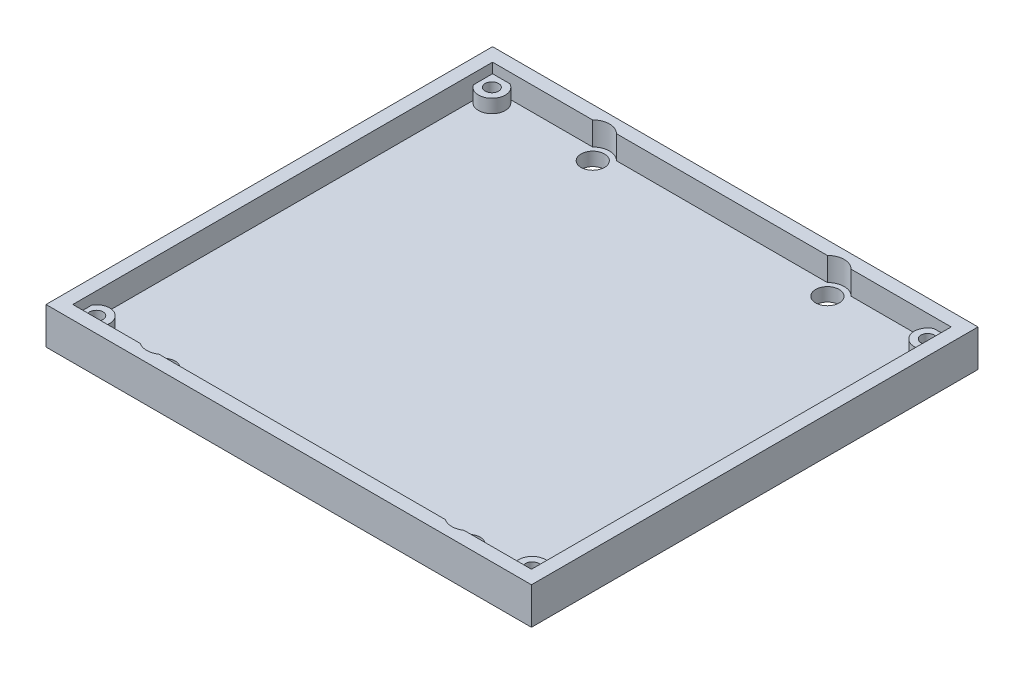
ISO-10303-21;
HEADER;
FILE_DESCRIPTION(('STEP AP214'),'2;1');
FILE_NAME('part.step','',(''),(''),'','','');
FILE_SCHEMA(('AUTOMOTIVE_DESIGN { 1 0 10303 214 1 1 1 1 }'));
ENDSEC;
DATA;
#1=APPLICATION_CONTEXT('core data for automotive mechanical design processes');
#2=APPLICATION_PROTOCOL_DEFINITION('international standard','automotive_design',2000,#1);
#3=PRODUCT_CONTEXT('',#1,'mechanical');
#4=PRODUCT('Part','Part','',(#3));
#5=PRODUCT_RELATED_PRODUCT_CATEGORY('part','',(#4));
#6=PRODUCT_DEFINITION_FORMATION('','',#4);
#7=PRODUCT_DEFINITION_CONTEXT('part definition',#1,'design');
#8=PRODUCT_DEFINITION('design','',#6,#7);
#9=PRODUCT_DEFINITION_SHAPE('','',#8);
#10=(LENGTH_UNIT() NAMED_UNIT(*) SI_UNIT(.MILLI.,.METRE.));
#11=(NAMED_UNIT(*) PLANE_ANGLE_UNIT() SI_UNIT($,.RADIAN.));
#12=(NAMED_UNIT(*) SI_UNIT($,.STERADIAN.) SOLID_ANGLE_UNIT());
#13=UNCERTAINTY_MEASURE_WITH_UNIT(LENGTH_MEASURE(1.E-05),#10,'distance_accuracy_value','');
#14=(GEOMETRIC_REPRESENTATION_CONTEXT(3) GLOBAL_UNCERTAINTY_ASSIGNED_CONTEXT((#13)) GLOBAL_UNIT_ASSIGNED_CONTEXT((#10,
#11,#12)) REPRESENTATION_CONTEXT('',''));
#15=CARTESIAN_POINT('',(0.,0.,0.));
#16=DIRECTION('',(0.,0.,1.));
#17=DIRECTION('',(1.,0.,0.));
#18=AXIS2_PLACEMENT_3D('',#15,#16,#17);
#19=CARTESIAN_POINT('',(0.,4.,0.));
#20=DIRECTION('',(0.,1.,0.));
#21=DIRECTION('',(0.,0.,1.));
#22=AXIS2_PLACEMENT_3D('',#19,#20,#21);
#23=PLANE('',#22);
#24=CARTESIAN_POINT('',(3.6999999999998,4.,-62.8));
#25=DIRECTION('',(0.,1.,0.));
#26=DIRECTION('',(0.,0.,1.));
#27=AXIS2_PLACEMENT_3D('',#24,#25,#26);
#28=CIRCLE('',#27,1.);
#29=CARTESIAN_POINT('',(3.6999999999998,4.,-61.8));
#30=VERTEX_POINT('',#29);
#31=EDGE_CURVE('E339',#30,#30,#28,.T.);
#32=ORIENTED_EDGE('',*,*,#31,.F.);
#33=EDGE_LOOP('',(#32));
#34=FACE_BOUND('',#33,.T.);
#35=CARTESIAN_POINT('',(3.6999999999998,4.,-62.8));
#36=DIRECTION('',(0.,1.,0.));
#37=DIRECTION('',(0.,0.,1.));
#38=AXIS2_PLACEMENT_3D('',#35,#36,#37);
#39=CIRCLE('',#38,2.);
#40=CARTESIAN_POINT('',(4.57177978870794,4.,-64.6));
#41=VERTEX_POINT('',#40);
#42=CARTESIAN_POINT('',(2.,4.,-61.7464346247144));
#43=VERTEX_POINT('',#42);
#44=EDGE_CURVE('E320',#41,#43,#39,.F.);
#45=ORIENTED_EDGE('',*,*,#44,.F.);
#46=DIRECTION('',(-1.,0.,0.));
#47=VECTOR('',#46,1.);
#48=CARTESIAN_POINT('',(16.9208761165389,4.,-64.6));
#49=LINE('',#48,#47);
#50=CARTESIAN_POINT('',(2.,4.,-64.6));
#51=VERTEX_POINT('',#50);
#52=EDGE_CURVE('E11',#41,#51,#49,.T.);
#53=ORIENTED_EDGE('',*,*,#52,.T.);
#54=DIRECTION('',(0.,0.,1.));
#55=VECTOR('',#54,1.);
#56=CARTESIAN_POINT('',(2.,4.,-2.));
#57=LINE('',#56,#55);
#58=EDGE_CURVE('E223',#51,#43,#57,.T.);
#59=ORIENTED_EDGE('',*,*,#58,.T.);
#60=EDGE_LOOP('',(#45,#53,#59));
#61=FACE_BOUND('',#60,.T.);
#62=ADVANCED_FACE('F41',(#34,#61),#23,.T.);
#63=CARTESIAN_POINT('',(3.7,4.,-3.8));
#64=DIRECTION('',(0.,1.,0.));
#65=DIRECTION('',(0.,0.,1.));
#66=AXIS2_PLACEMENT_3D('',#63,#64,#65);
#67=CIRCLE('',#66,1.);
#68=CARTESIAN_POINT('',(3.7,4.,-2.8));
#69=VERTEX_POINT('',#68);
#70=EDGE_CURVE('E327',#69,#69,#67,.T.);
#71=ORIENTED_EDGE('',*,*,#70,.F.);
#72=EDGE_LOOP('',(#71));
#73=FACE_BOUND('',#72,.T.);
#74=CARTESIAN_POINT('',(3.7,4.,-3.8));
#75=DIRECTION('',(0.,1.,0.));
#76=DIRECTION('',(0.,0.,1.));
#77=AXIS2_PLACEMENT_3D('',#74,#75,#76);
#78=CIRCLE('',#77,2.00000000000004);
#79=CARTESIAN_POINT('',(4.57177978870824,4.,-2.));
#80=VERTEX_POINT('',#79);
#81=CARTESIAN_POINT('',(2.,4.,-4.85356537528535));
#82=VERTEX_POINT('',#81);
#83=EDGE_CURVE('E316',#80,#82,#78,.T.);
#84=ORIENTED_EDGE('',*,*,#83,.T.);
#85=CARTESIAN_POINT('',(2.,4.,-2.));
#86=VERTEX_POINT('',#85);
#87=EDGE_CURVE('E51',#82,#86,#57,.T.);
#88=ORIENTED_EDGE('',*,*,#87,.T.);
#89=DIRECTION('',(1.,0.,0.));
#90=VECTOR('',#89,1.);
#91=CARTESIAN_POINT('',(12.0596299357219,4.,-2.));
#92=LINE('',#91,#90);
#93=EDGE_CURVE('E274',#86,#80,#92,.T.);
#94=ORIENTED_EDGE('',*,*,#93,.T.);
#95=EDGE_LOOP('',(#84,#88,#94));
#96=FACE_BOUND('',#95,.T.);
#97=ADVANCED_FACE('F608',(#73,#96),#23,.T.);
#98=CARTESIAN_POINT('',(68.7,4.,-3.8));
#99=DIRECTION('',(0.,1.,0.));
#100=DIRECTION('',(0.,0.,1.));
#101=AXIS2_PLACEMENT_3D('',#98,#99,#100);
#102=CIRCLE('',#101,0.999999999999998);
#103=CARTESIAN_POINT('',(68.7,4.,-2.8));
#104=VERTEX_POINT('',#103);
#105=EDGE_CURVE('E331',#104,#104,#102,.T.);
#106=ORIENTED_EDGE('',*,*,#105,.F.);
#107=EDGE_LOOP('',(#106));
#108=FACE_BOUND('',#107,.T.);
#109=CARTESIAN_POINT('',(68.7,4.,-3.8));
#110=DIRECTION('',(0.,1.,0.));
#111=DIRECTION('',(0.,0.,1.));
#112=AXIS2_PLACEMENT_3D('',#109,#110,#111);
#113=CIRCLE('',#112,2.00000000000004);
#114=CARTESIAN_POINT('',(67.828220211292,4.,-2.));
#115=VERTEX_POINT('',#114);
#116=CARTESIAN_POINT('',(70.4,4.,-4.85356537528536));
#117=VERTEX_POINT('',#116);
#118=EDGE_CURVE('E312',#115,#117,#113,.F.);
#119=ORIENTED_EDGE('',*,*,#118,.F.);
#120=DIRECTION('',(1.,0.,0.));
#121=VECTOR('',#120,1.);
#122=CARTESIAN_POINT('',(70.4,4.,-2.));
#123=LINE('',#122,#121);
#124=CARTESIAN_POINT('',(70.4,4.,-2.));
#125=VERTEX_POINT('',#124);
#126=EDGE_CURVE('E278',#115,#125,#123,.T.);
#127=ORIENTED_EDGE('',*,*,#126,.T.);
#128=DIRECTION('',(0.,0.,-1.));
#129=VECTOR('',#128,1.);
#130=CARTESIAN_POINT('',(70.4,4.,-2.));
#131=LINE('',#130,#129);
#132=EDGE_CURVE('E277',#125,#117,#131,.T.);
#133=ORIENTED_EDGE('',*,*,#132,.T.);
#134=EDGE_LOOP('',(#119,#127,#133));
#135=FACE_BOUND('',#134,.T.);
#136=ADVANCED_FACE('F564',(#108,#135),#23,.T.);
#137=CARTESIAN_POINT('',(68.6999999999998,4.,-62.8));
#138=DIRECTION('',(0.,1.,0.));
#139=DIRECTION('',(0.,0.,1.));
#140=AXIS2_PLACEMENT_3D('',#137,#138,#139);
#141=CIRCLE('',#140,0.999999999999998);
#142=CARTESIAN_POINT('',(68.6999999999998,4.,-61.8));
#143=VERTEX_POINT('',#142);
#144=EDGE_CURVE('E335',#143,#143,#141,.T.);
#145=ORIENTED_EDGE('',*,*,#144,.F.);
#146=EDGE_LOOP('',(#145));
#147=FACE_BOUND('',#146,.T.);
#148=CARTESIAN_POINT('',(68.6999999999998,4.,-62.8));
#149=DIRECTION('',(0.,1.,0.));
#150=DIRECTION('',(0.,0.,1.));
#151=AXIS2_PLACEMENT_3D('',#148,#149,#150);
#152=CIRCLE('',#151,2.00000000000008);
#153=CARTESIAN_POINT('',(67.828220211292,4.,-64.6));
#154=VERTEX_POINT('',#153);
#155=CARTESIAN_POINT('',(70.4,4.,-61.7464346247144));
#156=VERTEX_POINT('',#155);
#157=EDGE_CURVE('E324',#154,#156,#152,.T.);
#158=ORIENTED_EDGE('',*,*,#157,.T.);
#159=CARTESIAN_POINT('',(70.4,4.,-64.6));
#160=VERTEX_POINT('',#159);
#161=EDGE_CURVE('E281',#156,#160,#131,.T.);
#162=ORIENTED_EDGE('',*,*,#161,.T.);
#163=DIRECTION('',(-1.,0.,0.));
#164=VECTOR('',#163,1.);
#165=CARTESIAN_POINT('',(70.4,4.,-64.6));
#166=LINE('',#165,#164);
#167=EDGE_CURVE('E216',#160,#154,#166,.T.);
#168=ORIENTED_EDGE('',*,*,#167,.T.);
#169=EDGE_LOOP('',(#158,#162,#168));
#170=FACE_BOUND('',#169,.T.);
#171=ADVANCED_FACE('F538',(#147,#170),#23,.T.);
#172=CARTESIAN_POINT('',(0.,2.,0.));
#173=DIRECTION('',(0.,-1.,0.));
#174=DIRECTION('',(0.,0.,-1.));
#175=AXIS2_PLACEMENT_3D('',#172,#173,#174);
#176=PLANE('',#175);
#177=CARTESIAN_POINT('',(53.7,2.,-62.8436634128681));
#178=DIRECTION('',(0.,1.,0.));
#179=DIRECTION('',(0.,0.,-1.));
#180=AXIS2_PLACEMENT_3D('',#177,#178,#179);
#181=CIRCLE('',#180,1.75);
#182=CARTESIAN_POINT('',(53.7,2.,-64.5936634128681));
#183=VERTEX_POINT('',#182);
#184=EDGE_CURVE('E474',#183,#183,#181,.T.);
#185=ORIENTED_EDGE('',*,*,#184,.F.);
#186=EDGE_LOOP('',(#185));
#187=FACE_BOUND('',#186,.T.);
#188=CARTESIAN_POINT('',(58.95,2.,-4.07770813262099));
#189=DIRECTION('',(0.,1.,0.));
#190=DIRECTION('',(0.,0.,-1.));
#191=AXIS2_PLACEMENT_3D('',#188,#189,#190);
#192=CIRCLE('',#191,1.75000000000003);
#193=CARTESIAN_POINT('',(58.95,2.,-5.82770813262101));
#194=VERTEX_POINT('',#193);
#195=EDGE_CURVE('E482',#194,#194,#192,.T.);
#196=ORIENTED_EDGE('',*,*,#195,.F.);
#197=EDGE_LOOP('',(#196));
#198=FACE_BOUND('',#197,.T.);
#199=CARTESIAN_POINT('',(13.45,2.,-4.07770813262099));
#200=DIRECTION('',(0.,1.,0.));
#201=DIRECTION('',(0.,0.,1.));
#202=AXIS2_PLACEMENT_3D('',#199,#200,#201);
#203=CIRCLE('',#202,1.75);
#204=CARTESIAN_POINT('',(13.45,2.,-2.32770813262099));
#205=VERTEX_POINT('',#204);
#206=EDGE_CURVE('E490',#205,#205,#203,.T.);
#207=ORIENTED_EDGE('',*,*,#206,.F.);
#208=EDGE_LOOP('',(#207));
#209=FACE_BOUND('',#208,.T.);
#210=CARTESIAN_POINT('',(18.7,2.,-62.8436634128681));
#211=DIRECTION('',(0.,1.,0.));
#212=DIRECTION('',(0.,0.,1.));
#213=AXIS2_PLACEMENT_3D('',#210,#211,#212);
#214=CIRCLE('',#213,1.75000000000001);
#215=CARTESIAN_POINT('',(18.7,2.,-61.0936634128681));
#216=VERTEX_POINT('',#215);
#217=EDGE_CURVE('E498',#216,#216,#214,.T.);
#218=ORIENTED_EDGE('',*,*,#217,.F.);
#219=EDGE_LOOP('',(#218));
#220=FACE_BOUND('',#219,.T.);
#221=CARTESIAN_POINT('',(68.7,2.,-3.8));
#222=DIRECTION('',(0.,1.,0.));
#223=DIRECTION('',(0.,0.,1.));
#224=AXIS2_PLACEMENT_3D('',#221,#222,#223);
#225=CIRCLE('',#224,2.00000000000004);
#226=CARTESIAN_POINT('',(67.828220211292,2.,-2.));
#227=VERTEX_POINT('',#226);
#228=CARTESIAN_POINT('',(70.4,2.,-4.85356537528536));
#229=VERTEX_POINT('',#228);
#230=EDGE_CURVE('E346',#227,#229,#225,.F.);
#231=ORIENTED_EDGE('',*,*,#230,.T.);
#232=DIRECTION('',(0.,0.,-1.));
#233=VECTOR('',#232,1.);
#234=CARTESIAN_POINT('',(70.4,2.,0.));
#235=LINE('',#234,#233);
#236=CARTESIAN_POINT('',(70.4,2.,-61.7464346247144));
#237=VERTEX_POINT('',#236);
#238=EDGE_CURVE('E311',#229,#237,#235,.T.);
#239=ORIENTED_EDGE('',*,*,#238,.T.);
#240=CARTESIAN_POINT('',(68.6999999999998,2.,-62.8));
#241=DIRECTION('',(0.,1.,0.));
#242=DIRECTION('',(0.,0.,1.));
#243=AXIS2_PLACEMENT_3D('',#240,#241,#242);
#244=CIRCLE('',#243,2.00000000000008);
#245=CARTESIAN_POINT('',(67.8282202112919,2.,-64.6000000000002));
#246=VERTEX_POINT('',#245);
#247=EDGE_CURVE('E393',#246,#237,#244,.T.);
#248=ORIENTED_EDGE('',*,*,#247,.F.);
#249=DIRECTION('',(1.,0.,0.));
#250=VECTOR('',#249,1.);
#251=CARTESIAN_POINT('',(0.,2.,-64.6));
#252=LINE('',#251,#250);
#253=CARTESIAN_POINT('',(55.4791238834611,2.,-64.6));
#254=VERTEX_POINT('',#253);
#255=EDGE_CURVE('E389',#254,#246,#252,.T.);
#256=ORIENTED_EDGE('',*,*,#255,.F.);
#257=CARTESIAN_POINT('',(53.7,2.,-62.8436634128681));
#258=DIRECTION('',(0.,1.,0.));
#259=DIRECTION('',(0.,0.,1.));
#260=AXIS2_PLACEMENT_3D('',#257,#258,#259);
#261=CIRCLE('',#260,2.5);
#262=CARTESIAN_POINT('',(51.9208761165388,2.,-64.6));
#263=VERTEX_POINT('',#262);
#264=EDGE_CURVE('E385',#263,#254,#261,.F.);
#265=ORIENTED_EDGE('',*,*,#264,.F.);
#266=DIRECTION('',(1.,0.,0.));
#267=VECTOR('',#266,1.);
#268=CARTESIAN_POINT('',(0.,2.,-64.6));
#269=LINE('',#268,#267);
#270=CARTESIAN_POINT('',(20.4791238834611,2.,-64.6));
#271=VERTEX_POINT('',#270);
#272=EDGE_CURVE('E381',#271,#263,#269,.T.);
#273=ORIENTED_EDGE('',*,*,#272,.F.);
#274=CARTESIAN_POINT('',(18.7,2.,-62.8436634128681));
#275=DIRECTION('',(0.,1.,0.));
#276=DIRECTION('',(0.,0.,1.));
#277=AXIS2_PLACEMENT_3D('',#274,#275,#276);
#278=CIRCLE('',#277,2.5);
#279=CARTESIAN_POINT('',(16.9208761165389,2.,-64.6));
#280=VERTEX_POINT('',#279);
#281=EDGE_CURVE('E378',#271,#280,#278,.T.);
#282=ORIENTED_EDGE('',*,*,#281,.T.);
#283=DIRECTION('',(1.,0.,0.));
#284=VECTOR('',#283,1.);
#285=CARTESIAN_POINT('',(0.,2.,-64.6));
#286=LINE('',#285,#284);
#287=CARTESIAN_POINT('',(4.57177978870794,2.,-64.6));
#288=VERTEX_POINT('',#287);
#289=EDGE_CURVE('E375',#288,#280,#286,.T.);
#290=ORIENTED_EDGE('',*,*,#289,.F.);
#291=CARTESIAN_POINT('',(3.6999999999998,2.,-62.8));
#292=DIRECTION('',(0.,1.,0.));
#293=DIRECTION('',(0.,0.,1.));
#294=AXIS2_PLACEMENT_3D('',#291,#292,#293);
#295=CIRCLE('',#294,2.);
#296=CARTESIAN_POINT('',(2.,2.,-61.7464346247144));
#297=VERTEX_POINT('',#296);
#298=EDGE_CURVE('E372',#288,#297,#295,.F.);
#299=ORIENTED_EDGE('',*,*,#298,.T.);
#300=DIRECTION('',(0.,0.,-1.));
#301=VECTOR('',#300,1.);
#302=CARTESIAN_POINT('',(2.,2.,0.));
#303=LINE('',#302,#301);
#304=CARTESIAN_POINT('',(2.,2.,-4.85356537528535));
#305=VERTEX_POINT('',#304);
#306=EDGE_CURVE('E369',#305,#297,#303,.T.);
#307=ORIENTED_EDGE('',*,*,#306,.F.);
#308=CARTESIAN_POINT('',(3.7,2.,-3.8));
#309=DIRECTION('',(0.,1.,0.));
#310=DIRECTION('',(0.,0.,1.));
#311=AXIS2_PLACEMENT_3D('',#308,#309,#310);
#312=CIRCLE('',#311,2.00000000000004);
#313=CARTESIAN_POINT('',(4.57177978870824,2.,-2.));
#314=VERTEX_POINT('',#313);
#315=EDGE_CURVE('E365',#314,#305,#312,.T.);
#316=ORIENTED_EDGE('',*,*,#315,.F.);
#317=DIRECTION('',(1.,0.,0.));
#318=VECTOR('',#317,1.);
#319=CARTESIAN_POINT('',(0.,2.,-2.));
#320=LINE('',#319,#318);
#321=CARTESIAN_POINT('',(12.0596299357219,2.,-2.));
#322=VERTEX_POINT('',#321);
#323=EDGE_CURVE('E362',#314,#322,#320,.T.);
#324=ORIENTED_EDGE('',*,*,#323,.T.);
#325=CARTESIAN_POINT('',(13.45,2.,-4.07770813262099));
#326=DIRECTION('',(0.,1.,0.));
#327=DIRECTION('',(0.,0.,1.));
#328=AXIS2_PLACEMENT_3D('',#325,#326,#327);
#329=CIRCLE('',#328,2.5);
#330=CARTESIAN_POINT('',(14.8403700642781,2.,-2.));
#331=VERTEX_POINT('',#330);
#332=EDGE_CURVE('E359',#322,#331,#329,.T.);
#333=ORIENTED_EDGE('',*,*,#332,.T.);
#334=DIRECTION('',(1.,0.,0.));
#335=VECTOR('',#334,1.);
#336=CARTESIAN_POINT('',(0.,2.,-2.));
#337=LINE('',#336,#335);
#338=CARTESIAN_POINT('',(57.5596299357219,2.,-2.));
#339=VERTEX_POINT('',#338);
#340=EDGE_CURVE('E356',#331,#339,#337,.T.);
#341=ORIENTED_EDGE('',*,*,#340,.T.);
#342=CARTESIAN_POINT('',(58.95,2.,-4.07770813262099));
#343=DIRECTION('',(0.,1.,0.));
#344=DIRECTION('',(0.,0.,1.));
#345=AXIS2_PLACEMENT_3D('',#342,#343,#344);
#346=CIRCLE('',#345,2.5);
#347=CARTESIAN_POINT('',(60.340370064278,2.,-2.));
#348=VERTEX_POINT('',#347);
#349=EDGE_CURVE('E352',#348,#339,#346,.F.);
#350=ORIENTED_EDGE('',*,*,#349,.F.);
#351=DIRECTION('',(1.,0.,0.));
#352=VECTOR('',#351,1.);
#353=CARTESIAN_POINT('',(0.,2.,-1.99999999999998));
#354=LINE('',#353,#352);
#355=EDGE_CURVE('E349',#348,#227,#354,.T.);
#356=ORIENTED_EDGE('',*,*,#355,.T.);
#357=EDGE_LOOP('',(#231,#239,#248,#256,#265,#273,#282,#290,#299,#307,#316,#324,#333,#341,#350,#356));
#358=FACE_BOUND('',#357,.T.);
#359=ADVANCED_FACE('F556',(#187,#198,#209,#220,#358),#176,.F.);
#360=CARTESIAN_POINT('',(0.,0.,0.));
#361=DIRECTION('',(0.,-1.,0.));
#362=DIRECTION('',(0.,0.,-1.));
#363=AXIS2_PLACEMENT_3D('',#360,#361,#362);
#364=PLANE('',#363);
#365=CARTESIAN_POINT('',(58.95,0.,-4.07770813262099));
#366=DIRECTION('',(0.,1.,0.));
#367=DIRECTION('',(0.,0.,-1.));
#368=AXIS2_PLACEMENT_3D('',#365,#366,#367);
#369=CIRCLE('',#368,1.75000000000003);
#370=CARTESIAN_POINT('',(58.95,0.,-5.82770813262101));
#371=VERTEX_POINT('',#370);
#372=EDGE_CURVE('E478',#371,#371,#369,.T.);
#373=ORIENTED_EDGE('',*,*,#372,.T.);
#374=EDGE_LOOP('',(#373));
#375=FACE_BOUND('',#374,.T.);
#376=CARTESIAN_POINT('',(18.7,0.,-62.8436634128681));
#377=DIRECTION('',(0.,1.,0.));
#378=DIRECTION('',(0.,0.,1.));
#379=AXIS2_PLACEMENT_3D('',#376,#377,#378);
#380=CIRCLE('',#379,1.75000000000001);
#381=CARTESIAN_POINT('',(18.7,0.,-61.0936634128681));
#382=VERTEX_POINT('',#381);
#383=EDGE_CURVE('E494',#382,#382,#380,.T.);
#384=ORIENTED_EDGE('',*,*,#383,.T.);
#385=EDGE_LOOP('',(#384));
#386=FACE_BOUND('',#385,.T.);
#387=DIRECTION('',(0.,0.,1.));
#388=VECTOR('',#387,1.);
#389=CARTESIAN_POINT('',(0.,0.,0.));
#390=LINE('',#389,#388);
#391=CARTESIAN_POINT('',(0.,0.,-66.6));
#392=VERTEX_POINT('',#391);
#393=CARTESIAN_POINT('',(0.,0.,0.));
#394=VERTEX_POINT('',#393);
#395=EDGE_CURVE('E502',#392,#394,#390,.T.);
#396=ORIENTED_EDGE('',*,*,#395,.F.);
#397=DIRECTION('',(-1.,0.,0.));
#398=VECTOR('',#397,1.);
#399=CARTESIAN_POINT('',(0.,0.,-66.6));
#400=LINE('',#399,#398);
#401=CARTESIAN_POINT('',(72.4,0.,-66.6));
#402=VERTEX_POINT('',#401);
#403=EDGE_CURVE('E515',#402,#392,#400,.T.);
#404=ORIENTED_EDGE('',*,*,#403,.F.);
#405=DIRECTION('',(0.,0.,-1.));
#406=VECTOR('',#405,1.);
#407=CARTESIAN_POINT('',(72.4,0.,0.));
#408=LINE('',#407,#406);
#409=CARTESIAN_POINT('',(72.4,0.,0.));
#410=VERTEX_POINT('',#409);
#411=EDGE_CURVE('E512',#410,#402,#408,.T.);
#412=ORIENTED_EDGE('',*,*,#411,.F.);
#413=DIRECTION('',(1.,0.,0.));
#414=VECTOR('',#413,1.);
#415=CARTESIAN_POINT('',(0.,0.,0.));
#416=LINE('',#415,#414);
#417=EDGE_CURVE('E509',#394,#410,#416,.T.);
#418=ORIENTED_EDGE('',*,*,#417,.F.);
#419=EDGE_LOOP('',(#396,#404,#412,#418));
#420=FACE_BOUND('',#419,.T.);
#421=CARTESIAN_POINT('',(13.45,0.,-4.07770813262099));
#422=DIRECTION('',(0.,1.,0.));
#423=DIRECTION('',(0.,0.,1.));
#424=AXIS2_PLACEMENT_3D('',#421,#422,#423);
#425=CIRCLE('',#424,1.75);
#426=CARTESIAN_POINT('',(13.45,0.,-2.32770813262099));
#427=VERTEX_POINT('',#426);
#428=EDGE_CURVE('E486',#427,#427,#425,.T.);
#429=ORIENTED_EDGE('',*,*,#428,.T.);
#430=EDGE_LOOP('',(#429));
#431=FACE_BOUND('',#430,.T.);
#432=CARTESIAN_POINT('',(53.7,0.,-62.8436634128681));
#433=DIRECTION('',(0.,1.,0.));
#434=DIRECTION('',(0.,0.,-1.));
#435=AXIS2_PLACEMENT_3D('',#432,#433,#434);
#436=CIRCLE('',#435,1.75);
#437=CARTESIAN_POINT('',(53.7,0.,-64.5936634128681));
#438=VERTEX_POINT('',#437);
#439=EDGE_CURVE('E473',#438,#438,#436,.T.);
#440=ORIENTED_EDGE('',*,*,#439,.T.);
#441=EDGE_LOOP('',(#440));
#442=FACE_BOUND('',#441,.T.);
#443=ADVANCED_FACE('F624',(#375,#386,#420,#431,#442),#364,.T.);
#444=CARTESIAN_POINT('',(0.,2.,0.));
#445=DIRECTION('',(1.,0.,0.));
#446=DIRECTION('',(0.,0.,-1.));
#447=AXIS2_PLACEMENT_3D('',#444,#445,#446);
#448=PLANE('',#447);
#449=ORIENTED_EDGE('',*,*,#395,.T.);
#450=DIRECTION('',(0.,-1.,0.));
#451=VECTOR('',#450,1.);
#452=CARTESIAN_POINT('',(0.,2.,0.));
#453=LINE('',#452,#451);
#454=CARTESIAN_POINT('',(0.,5.5,0.));
#455=VERTEX_POINT('',#454);
#456=EDGE_CURVE('E45',#455,#394,#453,.T.);
#457=ORIENTED_EDGE('',*,*,#456,.F.);
#458=DIRECTION('',(0.,0.,1.));
#459=VECTOR('',#458,1.);
#460=CARTESIAN_POINT('',(0.,5.5,-66.6));
#461=LINE('',#460,#459);
#462=CARTESIAN_POINT('',(0.,5.5,-66.6));
#463=VERTEX_POINT('',#462);
#464=EDGE_CURVE('E225',#463,#455,#461,.T.);
#465=ORIENTED_EDGE('',*,*,#464,.F.);
#466=DIRECTION('',(0.,-1.,0.));
#467=VECTOR('',#466,1.);
#468=CARTESIAN_POINT('',(0.,2.,-66.6));
#469=LINE('',#468,#467);
#470=EDGE_CURVE('E518',#463,#392,#469,.T.);
#471=ORIENTED_EDGE('',*,*,#470,.T.);
#472=EDGE_LOOP('',(#449,#457,#465,#471));
#473=FACE_BOUND('',#472,.T.);
#474=ADVANCED_FACE('F43',(#473),#448,.F.);
#475=CARTESIAN_POINT('',(0.,2.,0.));
#476=DIRECTION('',(0.,0.,-1.));
#477=DIRECTION('',(-1.,0.,0.));
#478=AXIS2_PLACEMENT_3D('',#475,#476,#477);
#479=PLANE('',#478);
#480=ORIENTED_EDGE('',*,*,#417,.T.);
#481=DIRECTION('',(0.,-1.,0.));
#482=VECTOR('',#481,1.);
#483=CARTESIAN_POINT('',(72.4,2.,0.));
#484=LINE('',#483,#482);
#485=CARTESIAN_POINT('',(72.4,5.5,0.));
#486=VERTEX_POINT('',#485);
#487=EDGE_CURVE('E525',#486,#410,#484,.T.);
#488=ORIENTED_EDGE('',*,*,#487,.F.);
#489=DIRECTION('',(1.,0.,0.));
#490=VECTOR('',#489,1.);
#491=CARTESIAN_POINT('',(0.,5.5,0.));
#492=LINE('',#491,#490);
#493=EDGE_CURVE('E299',#455,#486,#492,.T.);
#494=ORIENTED_EDGE('',*,*,#493,.F.);
#495=ORIENTED_EDGE('',*,*,#456,.T.);
#496=EDGE_LOOP('',(#480,#488,#494,#495));
#497=FACE_BOUND('',#496,.T.);
#498=ADVANCED_FACE('F857',(#497),#479,.F.);
#499=CARTESIAN_POINT('',(72.4,2.,0.));
#500=DIRECTION('',(-1.,0.,0.));
#501=DIRECTION('',(0.,0.,1.));
#502=AXIS2_PLACEMENT_3D('',#499,#500,#501);
#503=PLANE('',#502);
#504=ORIENTED_EDGE('',*,*,#411,.T.);
#505=DIRECTION('',(0.,-1.,0.));
#506=VECTOR('',#505,1.);
#507=CARTESIAN_POINT('',(72.4,2.,-66.6));
#508=LINE('',#507,#506);
#509=CARTESIAN_POINT('',(72.4,5.5,-66.6));
#510=VERTEX_POINT('',#509);
#511=EDGE_CURVE('E522',#510,#402,#508,.T.);
#512=ORIENTED_EDGE('',*,*,#511,.F.);
#513=DIRECTION('',(0.,0.,-1.));
#514=VECTOR('',#513,1.);
#515=CARTESIAN_POINT('',(72.4,5.5,-66.6));
#516=LINE('',#515,#514);
#517=EDGE_CURVE('E303',#486,#510,#516,.T.);
#518=ORIENTED_EDGE('',*,*,#517,.F.);
#519=ORIENTED_EDGE('',*,*,#487,.T.);
#520=EDGE_LOOP('',(#504,#512,#518,#519));
#521=FACE_BOUND('',#520,.T.);
#522=ADVANCED_FACE('F844',(#521),#503,.F.);
#523=CARTESIAN_POINT('',(0.,2.,-66.6));
#524=DIRECTION('',(0.,0.,1.));
#525=DIRECTION('',(1.,0.,0.));
#526=AXIS2_PLACEMENT_3D('',#523,#524,#525);
#527=PLANE('',#526);
#528=ORIENTED_EDGE('',*,*,#403,.T.);
#529=ORIENTED_EDGE('',*,*,#470,.F.);
#530=DIRECTION('',(-1.,0.,0.));
#531=VECTOR('',#530,1.);
#532=CARTESIAN_POINT('',(0.,5.5,-66.6));
#533=LINE('',#532,#531);
#534=EDGE_CURVE('E307',#510,#463,#533,.T.);
#535=ORIENTED_EDGE('',*,*,#534,.F.);
#536=ORIENTED_EDGE('',*,*,#511,.T.);
#537=EDGE_LOOP('',(#528,#529,#535,#536));
#538=FACE_BOUND('',#537,.T.);
#539=ADVANCED_FACE('F838',(#538),#527,.F.);
#540=CARTESIAN_POINT('',(18.7,2.,-62.8436634128681));
#541=DIRECTION('',(0.,-1.,0.));
#542=DIRECTION('',(0.,0.,-1.));
#543=AXIS2_PLACEMENT_3D('',#540,#541,#542);
#544=CYLINDRICAL_SURFACE('',#543,1.75000000000001);
#545=ORIENTED_EDGE('',*,*,#217,.T.);
#546=EDGE_LOOP('',(#545));
#547=FACE_BOUND('',#546,.T.);
#548=ORIENTED_EDGE('',*,*,#383,.F.);
#549=EDGE_LOOP('',(#548));
#550=FACE_BOUND('',#549,.T.);
#551=ADVANCED_FACE('F843',(#547,#550),#544,.F.);
#552=CARTESIAN_POINT('',(13.45,2.,-4.07770813262099));
#553=DIRECTION('',(0.,-1.,0.));
#554=DIRECTION('',(0.,0.,-1.));
#555=AXIS2_PLACEMENT_3D('',#552,#553,#554);
#556=CYLINDRICAL_SURFACE('',#555,1.75);
#557=ORIENTED_EDGE('',*,*,#206,.T.);
#558=EDGE_LOOP('',(#557));
#559=FACE_BOUND('',#558,.T.);
#560=ORIENTED_EDGE('',*,*,#428,.F.);
#561=EDGE_LOOP('',(#560));
#562=FACE_BOUND('',#561,.T.);
#563=ADVANCED_FACE('F956',(#559,#562),#556,.F.);
#564=CARTESIAN_POINT('',(58.95,2.,-4.07770813262099));
#565=DIRECTION('',(0.,-1.,0.));
#566=DIRECTION('',(0.,0.,-1.));
#567=AXIS2_PLACEMENT_3D('',#564,#565,#566);
#568=CYLINDRICAL_SURFACE('',#567,1.75000000000003);
#569=ORIENTED_EDGE('',*,*,#195,.T.);
#570=EDGE_LOOP('',(#569));
#571=FACE_BOUND('',#570,.T.);
#572=ORIENTED_EDGE('',*,*,#372,.F.);
#573=EDGE_LOOP('',(#572));
#574=FACE_BOUND('',#573,.T.);
#575=ADVANCED_FACE('F964',(#571,#574),#568,.F.);
#576=CARTESIAN_POINT('',(53.7,2.,-62.8436634128681));
#577=DIRECTION('',(0.,-1.,0.));
#578=DIRECTION('',(0.,0.,-1.));
#579=AXIS2_PLACEMENT_3D('',#576,#577,#578);
#580=CYLINDRICAL_SURFACE('',#579,1.75);
#581=ORIENTED_EDGE('',*,*,#184,.T.);
#582=EDGE_LOOP('',(#581));
#583=FACE_BOUND('',#582,.T.);
#584=ORIENTED_EDGE('',*,*,#439,.F.);
#585=EDGE_LOOP('',(#584));
#586=FACE_BOUND('',#585,.T.);
#587=ADVANCED_FACE('F831',(#583,#586),#580,.F.);
#588=CARTESIAN_POINT('',(70.4,4.,0.));
#589=DIRECTION('',(-1.,0.,0.));
#590=DIRECTION('',(0.,0.,1.));
#591=AXIS2_PLACEMENT_3D('',#588,#589,#590);
#592=PLANE('',#591);
#593=ORIENTED_EDGE('',*,*,#238,.F.);
#594=DIRECTION('',(0.,-1.,0.));
#595=VECTOR('',#594,1.);
#596=CARTESIAN_POINT('',(70.4,4.,-4.85356537528536));
#597=LINE('',#596,#595);
#598=EDGE_CURVE('E469',#117,#229,#597,.T.);
#599=ORIENTED_EDGE('',*,*,#598,.F.);
#600=ORIENTED_EDGE('',*,*,#132,.F.);
#601=DIRECTION('',(0.,-1.,0.));
#602=VECTOR('',#601,1.);
#603=CARTESIAN_POINT('',(70.4,5.5,-2.));
#604=LINE('',#603,#602);
#605=CARTESIAN_POINT('',(70.4,5.5,-2.));
#606=VERTEX_POINT('',#605);
#607=EDGE_CURVE('E290',#606,#125,#604,.T.);
#608=ORIENTED_EDGE('',*,*,#607,.F.);
#609=DIRECTION('',(0.,0.,-1.));
#610=VECTOR('',#609,1.);
#611=CARTESIAN_POINT('',(70.4,5.5,-2.));
#612=LINE('',#611,#610);
#613=CARTESIAN_POINT('',(70.4,5.5,-64.6));
#614=VERTEX_POINT('',#613);
#615=EDGE_CURVE('E253',#606,#614,#612,.T.);
#616=ORIENTED_EDGE('',*,*,#615,.T.);
#617=DIRECTION('',(0.,-1.,0.));
#618=VECTOR('',#617,1.);
#619=CARTESIAN_POINT('',(70.4,5.5,-64.6));
#620=LINE('',#619,#618);
#621=EDGE_CURVE('E270',#614,#160,#620,.T.);
#622=ORIENTED_EDGE('',*,*,#621,.T.);
#623=ORIENTED_EDGE('',*,*,#161,.F.);
#624=DIRECTION('',(0.,-1.,0.));
#625=VECTOR('',#624,1.);
#626=CARTESIAN_POINT('',(70.4,4.,-61.7464346247144));
#627=LINE('',#626,#625);
#628=EDGE_CURVE('E343',#156,#237,#627,.T.);
#629=ORIENTED_EDGE('',*,*,#628,.T.);
#630=EDGE_LOOP('',(#593,#599,#600,#608,#616,#622,#623,#629));
#631=FACE_BOUND('',#630,.T.);
#632=ADVANCED_FACE('F544',(#631),#592,.T.);
#633=CARTESIAN_POINT('',(68.7,4.,-3.8));
#634=DIRECTION('',(0.,-1.,0.));
#635=DIRECTION('',(0.,0.,-1.));
#636=AXIS2_PLACEMENT_3D('',#633,#634,#635);
#637=CYLINDRICAL_SURFACE('',#636,2.00000000000004);
#638=ORIENTED_EDGE('',*,*,#230,.F.);
#639=DIRECTION('',(0.,-1.,0.));
#640=VECTOR('',#639,1.);
#641=CARTESIAN_POINT('',(67.828220211292,4.,-2.));
#642=LINE('',#641,#640);
#643=EDGE_CURVE('E465',#115,#227,#642,.T.);
#644=ORIENTED_EDGE('',*,*,#643,.F.);
#645=ORIENTED_EDGE('',*,*,#118,.T.);
#646=ORIENTED_EDGE('',*,*,#598,.T.);
#647=EDGE_LOOP('',(#638,#644,#645,#646));
#648=FACE_BOUND('',#647,.T.);
#649=ADVANCED_FACE('F560',(#648),#637,.T.);
#650=CARTESIAN_POINT('',(0.,4.,-1.99999999999998));
#651=DIRECTION('',(0.,0.,-1.));
#652=DIRECTION('',(-1.,0.,0.));
#653=AXIS2_PLACEMENT_3D('',#650,#651,#652);
#654=PLANE('',#653);
#655=ORIENTED_EDGE('',*,*,#355,.F.);
#656=DIRECTION('',(0.,-1.,0.));
#657=VECTOR('',#656,1.);
#658=CARTESIAN_POINT('',(60.340370064278,4.,-2.));
#659=LINE('',#658,#657);
#660=CARTESIAN_POINT('',(60.340370064278,5.5,-2.));
#661=VERTEX_POINT('',#660);
#662=EDGE_CURVE('E461',#661,#348,#659,.T.);
#663=ORIENTED_EDGE('',*,*,#662,.F.);
#664=DIRECTION('',(1.,0.,0.));
#665=VECTOR('',#664,1.);
#666=CARTESIAN_POINT('',(70.4,5.5,-2.));
#667=LINE('',#666,#665);
#668=EDGE_CURVE('E250',#661,#606,#667,.T.);
#669=ORIENTED_EDGE('',*,*,#668,.T.);
#670=ORIENTED_EDGE('',*,*,#607,.T.);
#671=ORIENTED_EDGE('',*,*,#126,.F.);
#672=ORIENTED_EDGE('',*,*,#643,.T.);
#673=EDGE_LOOP('',(#655,#663,#669,#670,#671,#672));
#674=FACE_BOUND('',#673,.T.);
#675=ADVANCED_FACE('F566',(#674),#654,.T.);
#676=CARTESIAN_POINT('',(58.95,4.,-4.07770813262099));
#677=DIRECTION('',(0.,-1.,0.));
#678=DIRECTION('',(0.,0.,-1.));
#679=AXIS2_PLACEMENT_3D('',#676,#677,#678);
#680=CYLINDRICAL_SURFACE('',#679,2.5);
#681=ORIENTED_EDGE('',*,*,#349,.T.);
#682=DIRECTION('',(0.,-1.,0.));
#683=VECTOR('',#682,1.);
#684=CARTESIAN_POINT('',(57.5596299357219,4.,-2.));
#685=LINE('',#684,#683);
#686=CARTESIAN_POINT('',(57.5596299357219,5.5,-2.));
#687=VERTEX_POINT('',#686);
#688=EDGE_CURVE('E457',#687,#339,#685,.T.);
#689=ORIENTED_EDGE('',*,*,#688,.F.);
#690=CARTESIAN_POINT('',(58.95,5.5,-4.07770813262099));
#691=DIRECTION('',(0.,1.,0.));
#692=DIRECTION('',(0.,0.,-1.));
#693=AXIS2_PLACEMENT_3D('',#690,#691,#692);
#694=CIRCLE('',#693,2.5);
#695=EDGE_CURVE('E246',#687,#661,#694,.T.);
#696=ORIENTED_EDGE('',*,*,#695,.T.);
#697=ORIENTED_EDGE('',*,*,#662,.T.);
#698=EDGE_LOOP('',(#681,#689,#696,#697));
#699=FACE_BOUND('',#698,.T.);
#700=ADVANCED_FACE('F598',(#699),#680,.F.);
#701=CARTESIAN_POINT('',(0.,4.,-2.));
#702=DIRECTION('',(0.,0.,-1.));
#703=DIRECTION('',(-1.,0.,0.));
#704=AXIS2_PLACEMENT_3D('',#701,#702,#703);
#705=PLANE('',#704);
#706=ORIENTED_EDGE('',*,*,#340,.F.);
#707=DIRECTION('',(0.,-1.,0.));
#708=VECTOR('',#707,1.);
#709=CARTESIAN_POINT('',(14.8403700642781,4.,-2.));
#710=LINE('',#709,#708);
#711=CARTESIAN_POINT('',(14.8403700642781,5.5,-2.));
#712=VERTEX_POINT('',#711);
#713=EDGE_CURVE('E453',#712,#331,#710,.T.);
#714=ORIENTED_EDGE('',*,*,#713,.F.);
#715=DIRECTION('',(1.,0.,0.));
#716=VECTOR('',#715,1.);
#717=CARTESIAN_POINT('',(57.5596299357219,5.5,-2.));
#718=LINE('',#717,#716);
#719=EDGE_CURVE('E242',#712,#687,#718,.T.);
#720=ORIENTED_EDGE('',*,*,#719,.T.);
#721=ORIENTED_EDGE('',*,*,#688,.T.);
#722=EDGE_LOOP('',(#706,#714,#720,#721));
#723=FACE_BOUND('',#722,.T.);
#724=ADVANCED_FACE('F596',(#723),#705,.T.);
#725=CARTESIAN_POINT('',(13.45,4.,-4.07770813262099));
#726=DIRECTION('',(0.,-1.,0.));
#727=DIRECTION('',(0.,0.,-1.));
#728=AXIS2_PLACEMENT_3D('',#725,#726,#727);
#729=CYLINDRICAL_SURFACE('',#728,2.5);
#730=ORIENTED_EDGE('',*,*,#332,.F.);
#731=DIRECTION('',(0.,-1.,0.));
#732=VECTOR('',#731,1.);
#733=CARTESIAN_POINT('',(12.0596299357219,4.,-2.));
#734=LINE('',#733,#732);
#735=CARTESIAN_POINT('',(12.0596299357219,5.5,-2.));
#736=VERTEX_POINT('',#735);
#737=EDGE_CURVE('E449',#736,#322,#734,.T.);
#738=ORIENTED_EDGE('',*,*,#737,.F.);
#739=CARTESIAN_POINT('',(13.45,5.5,-4.07770813262099));
#740=DIRECTION('',(0.,1.,0.));
#741=DIRECTION('',(0.,0.,1.));
#742=AXIS2_PLACEMENT_3D('',#739,#740,#741);
#743=CIRCLE('',#742,2.5);
#744=EDGE_CURVE('E236',#736,#712,#743,.T.);
#745=ORIENTED_EDGE('',*,*,#744,.T.);
#746=ORIENTED_EDGE('',*,*,#713,.T.);
#747=EDGE_LOOP('',(#730,#738,#745,#746));
#748=FACE_BOUND('',#747,.T.);
#749=ADVANCED_FACE('F593',(#748),#729,.F.);
#750=CARTESIAN_POINT('',(0.,4.,-2.));
#751=DIRECTION('',(0.,0.,-1.));
#752=DIRECTION('',(-1.,0.,0.));
#753=AXIS2_PLACEMENT_3D('',#750,#751,#752);
#754=PLANE('',#753);
#755=ORIENTED_EDGE('',*,*,#323,.F.);
#756=DIRECTION('',(0.,-1.,0.));
#757=VECTOR('',#756,1.);
#758=CARTESIAN_POINT('',(4.57177978870824,4.,-2.));
#759=LINE('',#758,#757);
#760=EDGE_CURVE('E445',#80,#314,#759,.T.);
#761=ORIENTED_EDGE('',*,*,#760,.F.);
#762=ORIENTED_EDGE('',*,*,#93,.F.);
#763=DIRECTION('',(0.,-1.,0.));
#764=VECTOR('',#763,1.);
#765=CARTESIAN_POINT('',(2.,5.5,-2.));
#766=LINE('',#765,#764);
#767=CARTESIAN_POINT('',(2.,5.5,-2.));
#768=VERTEX_POINT('',#767);
#769=EDGE_CURVE('E226',#768,#86,#766,.T.);
#770=ORIENTED_EDGE('',*,*,#769,.F.);
#771=DIRECTION('',(1.,0.,0.));
#772=VECTOR('',#771,1.);
#773=CARTESIAN_POINT('',(12.0596299357219,5.5,-2.));
#774=LINE('',#773,#772);
#775=EDGE_CURVE('E232',#768,#736,#774,.T.);
#776=ORIENTED_EDGE('',*,*,#775,.T.);
#777=ORIENTED_EDGE('',*,*,#737,.T.);
#778=EDGE_LOOP('',(#755,#761,#762,#770,#776,#777));
#779=FACE_BOUND('',#778,.T.);
#780=ADVANCED_FACE('F589',(#779),#754,.T.);
#781=CARTESIAN_POINT('',(3.7,4.,-3.8));
#782=DIRECTION('',(0.,-1.,0.));
#783=DIRECTION('',(0.,0.,-1.));
#784=AXIS2_PLACEMENT_3D('',#781,#782,#783);
#785=CYLINDRICAL_SURFACE('',#784,2.00000000000004);
#786=ORIENTED_EDGE('',*,*,#315,.T.);
#787=DIRECTION('',(0.,-1.,0.));
#788=VECTOR('',#787,1.);
#789=CARTESIAN_POINT('',(2.,4.,-4.85356537528535));
#790=LINE('',#789,#788);
#791=EDGE_CURVE('E441',#82,#305,#790,.T.);
#792=ORIENTED_EDGE('',*,*,#791,.F.);
#793=ORIENTED_EDGE('',*,*,#83,.F.);
#794=ORIENTED_EDGE('',*,*,#760,.T.);
#795=EDGE_LOOP('',(#786,#792,#793,#794));
#796=FACE_BOUND('',#795,.T.);
#797=ADVANCED_FACE('F583',(#796),#785,.T.);
#798=CARTESIAN_POINT('',(2.,4.,0.));
#799=DIRECTION('',(-1.,0.,0.));
#800=DIRECTION('',(0.,0.,1.));
#801=AXIS2_PLACEMENT_3D('',#798,#799,#800);
#802=PLANE('',#801);
#803=ORIENTED_EDGE('',*,*,#306,.T.);
#804=DIRECTION('',(0.,-1.,0.));
#805=VECTOR('',#804,1.);
#806=CARTESIAN_POINT('',(2.,4.,-61.7464346247144));
#807=LINE('',#806,#805);
#808=EDGE_CURVE('E437',#43,#297,#807,.T.);
#809=ORIENTED_EDGE('',*,*,#808,.F.);
#810=ORIENTED_EDGE('',*,*,#58,.F.);
#811=DIRECTION('',(0.,-1.,0.));
#812=VECTOR('',#811,1.);
#813=CARTESIAN_POINT('',(2.,5.5,-64.6));
#814=LINE('',#813,#812);
#815=CARTESIAN_POINT('',(2.,5.5,-64.6));
#816=VERTEX_POINT('',#815);
#817=EDGE_CURVE('E207',#816,#51,#814,.T.);
#818=ORIENTED_EDGE('',*,*,#817,.F.);
#819=DIRECTION('',(0.,0.,1.));
#820=VECTOR('',#819,1.);
#821=CARTESIAN_POINT('',(2.,5.5,-2.));
#822=LINE('',#821,#820);
#823=EDGE_CURVE('E215',#816,#768,#822,.T.);
#824=ORIENTED_EDGE('',*,*,#823,.T.);
#825=ORIENTED_EDGE('',*,*,#769,.T.);
#826=ORIENTED_EDGE('',*,*,#87,.F.);
#827=ORIENTED_EDGE('',*,*,#791,.T.);
#828=EDGE_LOOP('',(#803,#809,#810,#818,#824,#825,#826,#827));
#829=FACE_BOUND('',#828,.T.);
#830=ADVANCED_FACE('F220',(#829),#802,.F.);
#831=CARTESIAN_POINT('',(3.6999999999998,4.,-62.8));
#832=DIRECTION('',(0.,-1.,0.));
#833=DIRECTION('',(0.,0.,-1.));
#834=AXIS2_PLACEMENT_3D('',#831,#832,#833);
#835=CYLINDRICAL_SURFACE('',#834,2.);
#836=ORIENTED_EDGE('',*,*,#298,.F.);
#837=DIRECTION('',(0.,-1.,0.));
#838=VECTOR('',#837,1.);
#839=CARTESIAN_POINT('',(4.57177978870794,4.,-64.6));
#840=LINE('',#839,#838);
#841=EDGE_CURVE('E433',#41,#288,#840,.T.);
#842=ORIENTED_EDGE('',*,*,#841,.F.);
#843=ORIENTED_EDGE('',*,*,#44,.T.);
#844=ORIENTED_EDGE('',*,*,#808,.T.);
#845=EDGE_LOOP('',(#836,#842,#843,#844));
#846=FACE_BOUND('',#845,.T.);
#847=ADVANCED_FACE('F580',(#846),#835,.T.);
#848=CARTESIAN_POINT('',(0.,4.,-64.6));
#849=DIRECTION('',(0.,0.,-1.));
#850=DIRECTION('',(-1.,0.,0.));
#851=AXIS2_PLACEMENT_3D('',#848,#849,#850);
#852=PLANE('',#851);
#853=ORIENTED_EDGE('',*,*,#289,.T.);
#854=DIRECTION('',(0.,-1.,0.));
#855=VECTOR('',#854,1.);
#856=CARTESIAN_POINT('',(16.9208761165389,4.,-64.6));
#857=LINE('',#856,#855);
#858=CARTESIAN_POINT('',(16.9208761165389,5.5,-64.6));
#859=VERTEX_POINT('',#858);
#860=EDGE_CURVE('E209',#859,#280,#857,.T.);
#861=ORIENTED_EDGE('',*,*,#860,.F.);
#862=DIRECTION('',(-1.,0.,0.));
#863=VECTOR('',#862,1.);
#864=CARTESIAN_POINT('',(16.9208761165389,5.5,-64.6));
#865=LINE('',#864,#863);
#866=EDGE_CURVE('E203',#859,#816,#865,.T.);
#867=ORIENTED_EDGE('',*,*,#866,.T.);
#868=ORIENTED_EDGE('',*,*,#817,.T.);
#869=ORIENTED_EDGE('',*,*,#52,.F.);
#870=ORIENTED_EDGE('',*,*,#841,.T.);
#871=EDGE_LOOP('',(#853,#861,#867,#868,#869,#870));
#872=FACE_BOUND('',#871,.T.);
#873=ADVANCED_FACE('F206',(#872),#852,.F.);
#874=CARTESIAN_POINT('',(18.7,4.,-62.8436634128681));
#875=DIRECTION('',(0.,-1.,0.));
#876=DIRECTION('',(0.,0.,-1.));
#877=AXIS2_PLACEMENT_3D('',#874,#875,#876);
#878=CYLINDRICAL_SURFACE('',#877,2.5);
#879=ORIENTED_EDGE('',*,*,#281,.F.);
#880=DIRECTION('',(0.,-1.,0.));
#881=VECTOR('',#880,1.);
#882=CARTESIAN_POINT('',(20.4791238834611,4.,-64.6));
#883=LINE('',#882,#881);
#884=CARTESIAN_POINT('',(20.4791238834611,5.5,-64.6));
#885=VERTEX_POINT('',#884);
#886=EDGE_CURVE('E427',#885,#271,#883,.T.);
#887=ORIENTED_EDGE('',*,*,#886,.F.);
#888=CARTESIAN_POINT('',(18.7,5.5,-62.8436634128681));
#889=DIRECTION('',(0.,1.,0.));
#890=DIRECTION('',(0.,0.,-1.));
#891=AXIS2_PLACEMENT_3D('',#888,#889,#890);
#892=CIRCLE('',#891,2.50000000000001);
#893=EDGE_CURVE('E268',#885,#859,#892,.T.);
#894=ORIENTED_EDGE('',*,*,#893,.T.);
#895=ORIENTED_EDGE('',*,*,#860,.T.);
#896=EDGE_LOOP('',(#879,#887,#894,#895));
#897=FACE_BOUND('',#896,.T.);
#898=ADVANCED_FACE('F577',(#897),#878,.F.);
#899=CARTESIAN_POINT('',(0.,4.,-64.6));
#900=DIRECTION('',(0.,0.,-1.));
#901=DIRECTION('',(-1.,0.,0.));
#902=AXIS2_PLACEMENT_3D('',#899,#900,#901);
#903=PLANE('',#902);
#904=ORIENTED_EDGE('',*,*,#272,.T.);
#905=DIRECTION('',(0.,-1.,0.));
#906=VECTOR('',#905,1.);
#907=CARTESIAN_POINT('',(51.9208761165388,4.,-64.6));
#908=LINE('',#907,#906);
#909=CARTESIAN_POINT('',(51.9208761165388,5.5,-64.6));
#910=VERTEX_POINT('',#909);
#911=EDGE_CURVE('E423',#910,#263,#908,.T.);
#912=ORIENTED_EDGE('',*,*,#911,.F.);
#913=DIRECTION('',(-1.,0.,0.));
#914=VECTOR('',#913,1.);
#915=CARTESIAN_POINT('',(51.9208761165388,5.5,-64.6));
#916=LINE('',#915,#914);
#917=EDGE_CURVE('E264',#910,#885,#916,.T.);
#918=ORIENTED_EDGE('',*,*,#917,.T.);
#919=ORIENTED_EDGE('',*,*,#886,.T.);
#920=EDGE_LOOP('',(#904,#912,#918,#919));
#921=FACE_BOUND('',#920,.T.);
#922=ADVANCED_FACE('F574',(#921),#903,.F.);
#923=CARTESIAN_POINT('',(53.7,4.,-62.8436634128681));
#924=DIRECTION('',(0.,-1.,0.));
#925=DIRECTION('',(0.,0.,-1.));
#926=AXIS2_PLACEMENT_3D('',#923,#924,#925);
#927=CYLINDRICAL_SURFACE('',#926,2.5);
#928=ORIENTED_EDGE('',*,*,#264,.T.);
#929=DIRECTION('',(0.,-1.,0.));
#930=VECTOR('',#929,1.);
#931=CARTESIAN_POINT('',(55.4791238834611,4.,-64.6));
#932=LINE('',#931,#930);
#933=CARTESIAN_POINT('',(55.4791238834611,5.5,-64.6));
#934=VERTEX_POINT('',#933);
#935=EDGE_CURVE('E419',#934,#254,#932,.T.);
#936=ORIENTED_EDGE('',*,*,#935,.F.);
#937=CARTESIAN_POINT('',(53.7,5.5,-62.8436634128681));
#938=DIRECTION('',(0.,1.,0.));
#939=DIRECTION('',(0.,0.,-1.));
#940=AXIS2_PLACEMENT_3D('',#937,#938,#939);
#941=CIRCLE('',#940,2.50000000000001);
#942=EDGE_CURVE('E260',#934,#910,#941,.T.);
#943=ORIENTED_EDGE('',*,*,#942,.T.);
#944=ORIENTED_EDGE('',*,*,#911,.T.);
#945=EDGE_LOOP('',(#928,#936,#943,#944));
#946=FACE_BOUND('',#945,.T.);
#947=ADVANCED_FACE('F572',(#946),#927,.F.);
#948=CARTESIAN_POINT('',(0.,4.,-64.6));
#949=DIRECTION('',(0.,0.,-1.));
#950=DIRECTION('',(-1.,0.,0.));
#951=AXIS2_PLACEMENT_3D('',#948,#949,#950);
#952=PLANE('',#951);
#953=ORIENTED_EDGE('',*,*,#255,.T.);
#954=DIRECTION('',(0.,-1.,0.));
#955=VECTOR('',#954,1.);
#956=CARTESIAN_POINT('',(67.828220211292,4.,-64.6));
#957=LINE('',#956,#955);
#958=EDGE_CURVE('E415',#154,#246,#957,.T.);
#959=ORIENTED_EDGE('',*,*,#958,.F.);
#960=ORIENTED_EDGE('',*,*,#167,.F.);
#961=ORIENTED_EDGE('',*,*,#621,.F.);
#962=DIRECTION('',(-1.,0.,0.));
#963=VECTOR('',#962,1.);
#964=CARTESIAN_POINT('',(70.4,5.5,-64.6));
#965=LINE('',#964,#963);
#966=EDGE_CURVE('E256',#614,#934,#965,.T.);
#967=ORIENTED_EDGE('',*,*,#966,.T.);
#968=ORIENTED_EDGE('',*,*,#935,.T.);
#969=EDGE_LOOP('',(#953,#959,#960,#961,#967,#968));
#970=FACE_BOUND('',#969,.T.);
#971=ADVANCED_FACE('F550',(#970),#952,.F.);
#972=CARTESIAN_POINT('',(68.6999999999998,4.,-62.8));
#973=DIRECTION('',(0.,-1.,0.));
#974=DIRECTION('',(0.,0.,-1.));
#975=AXIS2_PLACEMENT_3D('',#972,#973,#974);
#976=CYLINDRICAL_SURFACE('',#975,0.999999999999998);
#977=ORIENTED_EDGE('',*,*,#144,.T.);
#978=EDGE_LOOP('',(#977));
#979=FACE_BOUND('',#978,.T.);
#980=CARTESIAN_POINT('',(68.6999999999998,2.,-62.8));
#981=DIRECTION('',(0.,1.,0.));
#982=DIRECTION('',(0.,0.,1.));
#983=AXIS2_PLACEMENT_3D('',#980,#981,#982);
#984=CIRCLE('',#983,0.999999999999998);
#985=CARTESIAN_POINT('',(68.6999999999998,2.,-61.8));
#986=VERTEX_POINT('',#985);
#987=EDGE_CURVE('E405',#986,#986,#984,.T.);
#988=ORIENTED_EDGE('',*,*,#987,.F.);
#989=EDGE_LOOP('',(#988));
#990=FACE_BOUND('',#989,.T.);
#991=ADVANCED_FACE('F632',(#979,#990),#976,.F.);
#992=CARTESIAN_POINT('',(68.7,4.,-3.8));
#993=DIRECTION('',(0.,-1.,0.));
#994=DIRECTION('',(0.,0.,-1.));
#995=AXIS2_PLACEMENT_3D('',#992,#993,#994);
#996=CYLINDRICAL_SURFACE('',#995,0.999999999999998);
#997=ORIENTED_EDGE('',*,*,#105,.T.);
#998=EDGE_LOOP('',(#997));
#999=FACE_BOUND('',#998,.T.);
#1000=CARTESIAN_POINT('',(68.7,2.,-3.8));
#1001=DIRECTION('',(0.,1.,0.));
#1002=DIRECTION('',(0.,0.,1.));
#1003=AXIS2_PLACEMENT_3D('',#1000,#1001,#1002);
#1004=CIRCLE('',#1003,0.999999999999998);
#1005=CARTESIAN_POINT('',(68.7,2.,-2.8));
#1006=VERTEX_POINT('',#1005);
#1007=EDGE_CURVE('E401',#1006,#1006,#1004,.T.);
#1008=ORIENTED_EDGE('',*,*,#1007,.F.);
#1009=EDGE_LOOP('',(#1008));
#1010=FACE_BOUND('',#1009,.T.);
#1011=ADVANCED_FACE('F635',(#999,#1010),#996,.F.);
#1012=CARTESIAN_POINT('',(3.7,4.,-3.8));
#1013=DIRECTION('',(0.,-1.,0.));
#1014=DIRECTION('',(0.,0.,-1.));
#1015=AXIS2_PLACEMENT_3D('',#1012,#1013,#1014);
#1016=CYLINDRICAL_SURFACE('',#1015,1.);
#1017=ORIENTED_EDGE('',*,*,#70,.T.);
#1018=EDGE_LOOP('',(#1017));
#1019=FACE_BOUND('',#1018,.T.);
#1020=CARTESIAN_POINT('',(3.7,2.,-3.8));
#1021=DIRECTION('',(0.,1.,0.));
#1022=DIRECTION('',(0.,0.,1.));
#1023=AXIS2_PLACEMENT_3D('',#1020,#1021,#1022);
#1024=CIRCLE('',#1023,1.);
#1025=CARTESIAN_POINT('',(3.7,2.,-2.8));
#1026=VERTEX_POINT('',#1025);
#1027=EDGE_CURVE('E397',#1026,#1026,#1024,.T.);
#1028=ORIENTED_EDGE('',*,*,#1027,.F.);
#1029=EDGE_LOOP('',(#1028));
#1030=FACE_BOUND('',#1029,.T.);
#1031=ADVANCED_FACE('F664',(#1019,#1030),#1016,.F.);
#1032=CARTESIAN_POINT('',(68.6999999999998,4.,-62.8));
#1033=DIRECTION('',(0.,-1.,0.));
#1034=DIRECTION('',(0.,0.,-1.));
#1035=AXIS2_PLACEMENT_3D('',#1032,#1033,#1034);
#1036=CYLINDRICAL_SURFACE('',#1035,2.00000000000008);
#1037=ORIENTED_EDGE('',*,*,#247,.T.);
#1038=ORIENTED_EDGE('',*,*,#628,.F.);
#1039=ORIENTED_EDGE('',*,*,#157,.F.);
#1040=ORIENTED_EDGE('',*,*,#958,.T.);
#1041=EDGE_LOOP('',(#1037,#1038,#1039,#1040));
#1042=FACE_BOUND('',#1041,.T.);
#1043=ADVANCED_FACE('F552',(#1042),#1036,.T.);
#1044=CARTESIAN_POINT('',(3.6999999999998,4.,-62.8));
#1045=DIRECTION('',(0.,-1.,0.));
#1046=DIRECTION('',(0.,0.,-1.));
#1047=AXIS2_PLACEMENT_3D('',#1044,#1045,#1046);
#1048=CYLINDRICAL_SURFACE('',#1047,1.);
#1049=ORIENTED_EDGE('',*,*,#31,.T.);
#1050=EDGE_LOOP('',(#1049));
#1051=FACE_BOUND('',#1050,.T.);
#1052=CARTESIAN_POINT('',(3.6999999999998,2.,-62.8));
#1053=DIRECTION('',(0.,1.,0.));
#1054=DIRECTION('',(0.,0.,1.));
#1055=AXIS2_PLACEMENT_3D('',#1052,#1053,#1054);
#1056=CIRCLE('',#1055,1.);
#1057=CARTESIAN_POINT('',(3.6999999999998,2.,-61.8));
#1058=VERTEX_POINT('',#1057);
#1059=EDGE_CURVE('E317',#1058,#1058,#1056,.T.);
#1060=ORIENTED_EDGE('',*,*,#1059,.F.);
#1061=EDGE_LOOP('',(#1060));
#1062=FACE_BOUND('',#1061,.T.);
#1063=ADVANCED_FACE('F651',(#1051,#1062),#1048,.F.);
#1064=ORIENTED_EDGE('',*,*,#1059,.T.);
#1065=EDGE_LOOP('',(#1064));
#1066=FACE_BOUND('',#1065,.T.);
#1067=ADVANCED_FACE('F627',(#1066),#176,.F.);
#1068=ORIENTED_EDGE('',*,*,#1027,.T.);
#1069=EDGE_LOOP('',(#1068));
#1070=FACE_BOUND('',#1069,.T.);
#1071=ADVANCED_FACE('F628',(#1070),#176,.F.);
#1072=ORIENTED_EDGE('',*,*,#1007,.T.);
#1073=EDGE_LOOP('',(#1072));
#1074=FACE_BOUND('',#1073,.T.);
#1075=ADVANCED_FACE('F641',(#1074),#176,.F.);
#1076=ORIENTED_EDGE('',*,*,#987,.T.);
#1077=EDGE_LOOP('',(#1076));
#1078=FACE_BOUND('',#1077,.T.);
#1079=ADVANCED_FACE('F639',(#1078),#176,.F.);
#1080=CARTESIAN_POINT('',(0.,5.5,0.));
#1081=DIRECTION('',(0.,1.,0.));
#1082=DIRECTION('',(0.,0.,1.));
#1083=AXIS2_PLACEMENT_3D('',#1080,#1081,#1082);
#1084=PLANE('',#1083);
#1085=ORIENTED_EDGE('',*,*,#464,.T.);
#1086=ORIENTED_EDGE('',*,*,#493,.T.);
#1087=ORIENTED_EDGE('',*,*,#517,.T.);
#1088=ORIENTED_EDGE('',*,*,#534,.T.);
#1089=EDGE_LOOP('',(#1085,#1086,#1087,#1088));
#1090=FACE_BOUND('',#1089,.T.);
#1091=ORIENTED_EDGE('',*,*,#823,.F.);
#1092=ORIENTED_EDGE('',*,*,#866,.F.);
#1093=ORIENTED_EDGE('',*,*,#893,.F.);
#1094=ORIENTED_EDGE('',*,*,#917,.F.);
#1095=ORIENTED_EDGE('',*,*,#942,.F.);
#1096=ORIENTED_EDGE('',*,*,#966,.F.);
#1097=ORIENTED_EDGE('',*,*,#615,.F.);
#1098=ORIENTED_EDGE('',*,*,#668,.F.);
#1099=ORIENTED_EDGE('',*,*,#695,.F.);
#1100=ORIENTED_EDGE('',*,*,#719,.F.);
#1101=ORIENTED_EDGE('',*,*,#744,.F.);
#1102=ORIENTED_EDGE('',*,*,#775,.F.);
#1103=EDGE_LOOP('',(#1091,#1092,#1093,#1094,#1095,#1096,#1097,#1098,#1099,#1100,#1101,#1102));
#1104=FACE_BOUND('',#1103,.T.);
#1105=ADVANCED_FACE('F229',(#1090,#1104),#1084,.T.);
#1106=CLOSED_SHELL('',(#62,#97,#136,#171,#359,#443,#474,#498,#522,#539,#551,#563,#575,#587,#632,
#649,#675,#700,#724,#749,#780,#797,#830,#847,#873,#898,#922,#947,#971,#991,#1011,#1031,#1043,
#1063,#1067,#1071,#1075,#1079,#1105));
#1107=MANIFOLD_SOLID_BREP('B2',#1106);
#1108=ADVANCED_BREP_SHAPE_REPRESENTATION('',(#18,#1107),#14);
#1109=SHAPE_DEFINITION_REPRESENTATION(#9,#1108);
ENDSEC;
END-ISO-10303-21;
